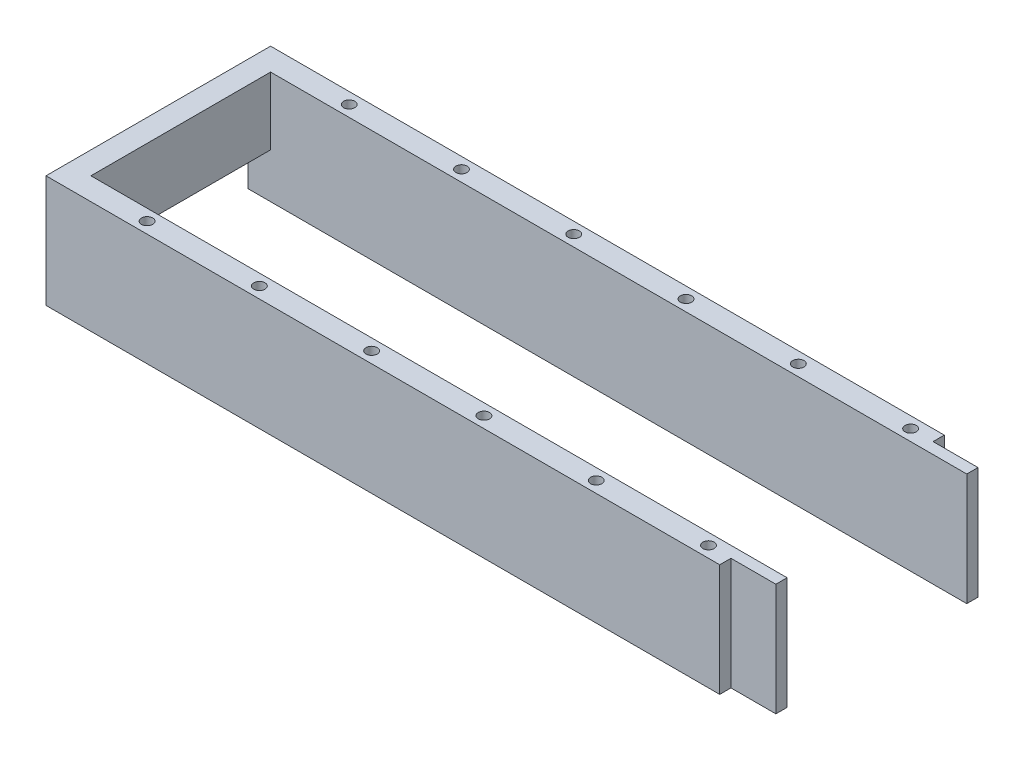
ISO-10303-21;
HEADER;
FILE_DESCRIPTION(('STEP AP214'),'2;1');
FILE_NAME('part.step','',(''),(''),'','','');
FILE_SCHEMA(('AUTOMOTIVE_DESIGN { 1 0 10303 214 1 1 1 1 }'));
ENDSEC;
DATA;
#1=APPLICATION_CONTEXT('core data for automotive mechanical design processes');
#2=APPLICATION_PROTOCOL_DEFINITION('international standard','automotive_design',2000,#1);
#3=PRODUCT_CONTEXT('',#1,'mechanical');
#4=PRODUCT('Part','Part','',(#3));
#5=PRODUCT_RELATED_PRODUCT_CATEGORY('part','',(#4));
#6=PRODUCT_DEFINITION_FORMATION('','',#4);
#7=PRODUCT_DEFINITION_CONTEXT('part definition',#1,'design');
#8=PRODUCT_DEFINITION('design','',#6,#7);
#9=PRODUCT_DEFINITION_SHAPE('','',#8);
#10=(LENGTH_UNIT() NAMED_UNIT(*) SI_UNIT(.MILLI.,.METRE.));
#11=(NAMED_UNIT(*) PLANE_ANGLE_UNIT() SI_UNIT($,.RADIAN.));
#12=(NAMED_UNIT(*) SI_UNIT($,.STERADIAN.) SOLID_ANGLE_UNIT());
#13=UNCERTAINTY_MEASURE_WITH_UNIT(LENGTH_MEASURE(1.E-05),#10,'distance_accuracy_value','');
#14=(GEOMETRIC_REPRESENTATION_CONTEXT(3) GLOBAL_UNCERTAINTY_ASSIGNED_CONTEXT((#13)) GLOBAL_UNIT_ASSIGNED_CONTEXT((#10,
#11,#12)) REPRESENTATION_CONTEXT('',''));
#15=CARTESIAN_POINT('',(0.,0.,0.));
#16=DIRECTION('',(0.,0.,1.));
#17=DIRECTION('',(1.,0.,0.));
#18=AXIS2_PLACEMENT_3D('',#15,#16,#17);
#19=CARTESIAN_POINT('',(-101.6,31.75,3.17499999999999));
#20=DIRECTION('',(0.,0.,-1.));
#21=DIRECTION('',(-1.,0.,0.));
#22=AXIS2_PLACEMENT_3D('',#19,#20,#21);
#23=PLANE('',#22);
#24=DIRECTION('',(0.,1.,0.));
#25=VECTOR('',#24,1.);
#26=CARTESIAN_POINT('',(-95.25,31.75,3.17499999999999));
#27=LINE('',#26,#25);
#28=CARTESIAN_POINT('',(-95.25,12.7,3.17499999999999));
#29=VERTEX_POINT('',#28);
#30=CARTESIAN_POINT('',(-95.25,31.75,3.17499999999999));
#31=VERTEX_POINT('',#30);
#32=EDGE_CURVE('E293',#29,#31,#27,.T.);
#33=ORIENTED_EDGE('',*,*,#32,.F.);
#34=DIRECTION('',(1.,0.,0.));
#35=VECTOR('',#34,1.);
#36=CARTESIAN_POINT('',(-101.6,12.7,3.17499999999999));
#37=LINE('',#36,#35);
#38=CARTESIAN_POINT('',(-101.6,12.7,3.17499999999999));
#39=VERTEX_POINT('',#38);
#40=EDGE_CURVE('E287',#39,#29,#37,.T.);
#41=ORIENTED_EDGE('',*,*,#40,.F.);
#42=DIRECTION('',(0.,-1.,0.));
#43=VECTOR('',#42,1.);
#44=CARTESIAN_POINT('',(-101.6,31.75,3.17499999999999));
#45=LINE('',#44,#43);
#46=CARTESIAN_POINT('',(-101.6,0.,3.17499999999999));
#47=VERTEX_POINT('',#46);
#48=EDGE_CURVE('E53',#39,#47,#45,.T.);
#49=ORIENTED_EDGE('',*,*,#48,.T.);
#50=DIRECTION('',(1.,0.,0.));
#51=VECTOR('',#50,1.);
#52=CARTESIAN_POINT('',(-101.6,0.,3.17499999999999));
#53=LINE('',#52,#51);
#54=CARTESIAN_POINT('',(101.6,0.,3.17499999999999));
#55=VERTEX_POINT('',#54);
#56=EDGE_CURVE('E369',#47,#55,#53,.T.);
#57=ORIENTED_EDGE('',*,*,#56,.T.);
#58=DIRECTION('',(0.,-1.,0.));
#59=VECTOR('',#58,1.);
#60=CARTESIAN_POINT('',(101.6,31.75,3.17499999999999));
#61=LINE('',#60,#59);
#62=CARTESIAN_POINT('',(101.6,31.75,3.17499999999999));
#63=VERTEX_POINT('',#62);
#64=EDGE_CURVE('E379',#63,#55,#61,.T.);
#65=ORIENTED_EDGE('',*,*,#64,.F.);
#66=DIRECTION('',(1.,0.,0.));
#67=VECTOR('',#66,1.);
#68=CARTESIAN_POINT('',(-101.6,31.75,3.17499999999999));
#69=LINE('',#68,#67);
#70=EDGE_CURVE('E376',#31,#63,#69,.T.);
#71=ORIENTED_EDGE('',*,*,#70,.F.);
#72=EDGE_LOOP('',(#33,#41,#49,#57,#65,#71));
#73=FACE_BOUND('',#72,.T.);
#74=ADVANCED_FACE('F44',(#73),#23,.F.);
#75=CARTESIAN_POINT('',(0.,31.75,0.));
#76=DIRECTION('',(0.,-1.,0.));
#77=DIRECTION('',(0.,0.,-1.));
#78=AXIS2_PLACEMENT_3D('',#75,#76,#77);
#79=PLANE('',#78);
#80=DIRECTION('',(0.,0.,-1.));
#81=VECTOR('',#80,1.);
#82=CARTESIAN_POINT('',(101.6,31.75,3.17499999999999));
#83=LINE('',#82,#81);
#84=CARTESIAN_POINT('',(101.6,31.75,0.));
#85=VERTEX_POINT('',#84);
#86=EDGE_CURVE('E364',#63,#85,#83,.T.);
#87=ORIENTED_EDGE('',*,*,#86,.T.);
#88=DIRECTION('',(1.,0.,0.));
#89=VECTOR('',#88,1.);
#90=CARTESIAN_POINT('',(101.6,31.75,0.));
#91=LINE('',#90,#89);
#92=CARTESIAN_POINT('',(88.9,31.75,0.));
#93=VERTEX_POINT('',#92);
#94=EDGE_CURVE('E170',#93,#85,#91,.T.);
#95=ORIENTED_EDGE('',*,*,#94,.F.);
#96=DIRECTION('',(0.,0.,1.));
#97=VECTOR('',#96,1.);
#98=CARTESIAN_POINT('',(88.9,31.75,-3.17499999999999));
#99=LINE('',#98,#97);
#100=CARTESIAN_POINT('',(88.9,31.75,-3.17499999999999));
#101=VERTEX_POINT('',#100);
#102=EDGE_CURVE('E148',#101,#93,#99,.T.);
#103=ORIENTED_EDGE('',*,*,#102,.F.);
#104=DIRECTION('',(-1.,0.,0.));
#105=VECTOR('',#104,1.);
#106=CARTESIAN_POINT('',(-101.6,31.75,-3.17500000000001));
#107=LINE('',#106,#105);
#108=CARTESIAN_POINT('',(-101.6,31.75,-3.17500000000001));
#109=VERTEX_POINT('',#108);
#110=EDGE_CURVE('E368',#101,#109,#107,.T.);
#111=ORIENTED_EDGE('',*,*,#110,.T.);
#112=DIRECTION('',(0.,0.,1.));
#113=VECTOR('',#112,1.);
#114=CARTESIAN_POINT('',(-101.6,31.75,3.17499999999999));
#115=LINE('',#114,#113);
#116=CARTESIAN_POINT('',(-101.6,31.75,60.325));
#117=VERTEX_POINT('',#116);
#118=EDGE_CURVE('E372',#109,#117,#115,.T.);
#119=ORIENTED_EDGE('',*,*,#118,.T.);
#120=DIRECTION('',(-1.,0.,0.));
#121=VECTOR('',#120,1.);
#122=CARTESIAN_POINT('',(-101.6,31.75,60.325));
#123=LINE('',#122,#121);
#124=CARTESIAN_POINT('',(88.9,31.75,60.325));
#125=VERTEX_POINT('',#124);
#126=EDGE_CURVE('E261',#125,#117,#123,.T.);
#127=ORIENTED_EDGE('',*,*,#126,.F.);
#128=DIRECTION('',(0.,0.,1.));
#129=VECTOR('',#128,1.);
#130=CARTESIAN_POINT('',(88.9,31.75,60.325));
#131=LINE('',#130,#129);
#132=CARTESIAN_POINT('',(88.9,31.75,57.15));
#133=VERTEX_POINT('',#132);
#134=EDGE_CURVE('E193',#133,#125,#131,.T.);
#135=ORIENTED_EDGE('',*,*,#134,.F.);
#136=DIRECTION('',(-1.,0.,0.));
#137=VECTOR('',#136,1.);
#138=CARTESIAN_POINT('',(101.6,31.75,57.15));
#139=LINE('',#138,#137);
#140=CARTESIAN_POINT('',(101.6,31.75,57.15));
#141=VERTEX_POINT('',#140);
#142=EDGE_CURVE('E176',#141,#133,#139,.T.);
#143=ORIENTED_EDGE('',*,*,#142,.F.);
#144=DIRECTION('',(0.,0.,1.));
#145=VECTOR('',#144,1.);
#146=CARTESIAN_POINT('',(101.6,31.75,53.975));
#147=LINE('',#146,#145);
#148=CARTESIAN_POINT('',(101.6,31.75,53.975));
#149=VERTEX_POINT('',#148);
#150=EDGE_CURVE('E253',#149,#141,#147,.T.);
#151=ORIENTED_EDGE('',*,*,#150,.F.);
#152=DIRECTION('',(1.,0.,0.));
#153=VECTOR('',#152,1.);
#154=CARTESIAN_POINT('',(-101.6,31.75,53.975));
#155=LINE('',#154,#153);
#156=CARTESIAN_POINT('',(-95.25,31.75,53.975));
#157=VERTEX_POINT('',#156);
#158=EDGE_CURVE('E257',#157,#149,#155,.T.);
#159=ORIENTED_EDGE('',*,*,#158,.F.);
#160=DIRECTION('',(0.,0.,-1.));
#161=VECTOR('',#160,1.);
#162=CARTESIAN_POINT('',(-95.25,31.75,53.975));
#163=LINE('',#162,#161);
#164=EDGE_CURVE('E297',#157,#31,#163,.T.);
#165=ORIENTED_EDGE('',*,*,#164,.T.);
#166=ORIENTED_EDGE('',*,*,#70,.T.);
#167=EDGE_LOOP('',(#87,#95,#103,#111,#119,#127,#135,#143,#151,#159,#165,#166));
#168=FACE_BOUND('',#167,.T.);
#169=CARTESIAN_POINT('',(-76.2,31.75,0.));
#170=DIRECTION('',(0.,1.,0.));
#171=DIRECTION('',(0.,0.,1.));
#172=AXIS2_PLACEMENT_3D('',#169,#170,#171);
#173=CIRCLE('',#172,1.5875);
#174=CARTESIAN_POINT('',(-76.2,31.75,1.5875));
#175=VERTEX_POINT('',#174);
#176=EDGE_CURVE('E356',#175,#175,#173,.T.);
#177=ORIENTED_EDGE('',*,*,#176,.F.);
#178=EDGE_LOOP('',(#177));
#179=FACE_BOUND('',#178,.T.);
#180=CARTESIAN_POINT('',(-44.45,31.75,0.));
#181=DIRECTION('',(0.,1.,0.));
#182=DIRECTION('',(0.,0.,1.));
#183=AXIS2_PLACEMENT_3D('',#180,#181,#182);
#184=CIRCLE('',#183,1.5875);
#185=CARTESIAN_POINT('',(-44.45,31.75,1.5875));
#186=VERTEX_POINT('',#185);
#187=EDGE_CURVE('E348',#186,#186,#184,.T.);
#188=ORIENTED_EDGE('',*,*,#187,.F.);
#189=EDGE_LOOP('',(#188));
#190=FACE_BOUND('',#189,.T.);
#191=CARTESIAN_POINT('',(-12.7,31.75,0.));
#192=DIRECTION('',(0.,1.,0.));
#193=DIRECTION('',(0.,0.,1.));
#194=AXIS2_PLACEMENT_3D('',#191,#192,#193);
#195=CIRCLE('',#194,1.5875);
#196=CARTESIAN_POINT('',(-12.7,31.75,1.5875));
#197=VERTEX_POINT('',#196);
#198=EDGE_CURVE('E340',#197,#197,#195,.T.);
#199=ORIENTED_EDGE('',*,*,#198,.F.);
#200=EDGE_LOOP('',(#199));
#201=FACE_BOUND('',#200,.T.);
#202=CARTESIAN_POINT('',(19.05,31.75,0.));
#203=DIRECTION('',(0.,1.,0.));
#204=DIRECTION('',(0.,0.,1.));
#205=AXIS2_PLACEMENT_3D('',#202,#203,#204);
#206=CIRCLE('',#205,1.5875);
#207=CARTESIAN_POINT('',(19.05,31.75,1.5875));
#208=VERTEX_POINT('',#207);
#209=EDGE_CURVE('E332',#208,#208,#206,.T.);
#210=ORIENTED_EDGE('',*,*,#209,.F.);
#211=EDGE_LOOP('',(#210));
#212=FACE_BOUND('',#211,.T.);
#213=CARTESIAN_POINT('',(50.8,31.75,0.));
#214=DIRECTION('',(0.,1.,0.));
#215=DIRECTION('',(0.,0.,1.));
#216=AXIS2_PLACEMENT_3D('',#213,#214,#215);
#217=CIRCLE('',#216,1.5875);
#218=CARTESIAN_POINT('',(50.8,31.75,1.5875));
#219=VERTEX_POINT('',#218);
#220=EDGE_CURVE('E324',#219,#219,#217,.T.);
#221=ORIENTED_EDGE('',*,*,#220,.F.);
#222=EDGE_LOOP('',(#221));
#223=FACE_BOUND('',#222,.T.);
#224=CARTESIAN_POINT('',(82.55,31.75,0.));
#225=DIRECTION('',(0.,1.,0.));
#226=DIRECTION('',(0.,0.,1.));
#227=AXIS2_PLACEMENT_3D('',#224,#225,#226);
#228=CIRCLE('',#227,1.5875);
#229=CARTESIAN_POINT('',(82.55,31.75,1.5875));
#230=VERTEX_POINT('',#229);
#231=EDGE_CURVE('E316',#230,#230,#228,.T.);
#232=ORIENTED_EDGE('',*,*,#231,.F.);
#233=EDGE_LOOP('',(#232));
#234=FACE_BOUND('',#233,.T.);
#235=CARTESIAN_POINT('',(82.55,31.75,57.15));
#236=DIRECTION('',(0.,-1.,0.));
#237=DIRECTION('',(0.,0.,-1.));
#238=AXIS2_PLACEMENT_3D('',#235,#236,#237);
#239=CIRCLE('',#238,1.5875);
#240=CARTESIAN_POINT('',(82.55,31.75,55.5625));
#241=VERTEX_POINT('',#240);
#242=EDGE_CURVE('E205',#241,#241,#239,.T.);
#243=ORIENTED_EDGE('',*,*,#242,.T.);
#244=EDGE_LOOP('',(#243));
#245=FACE_BOUND('',#244,.T.);
#246=CARTESIAN_POINT('',(50.8,31.75,57.15));
#247=DIRECTION('',(0.,-1.,0.));
#248=DIRECTION('',(0.,0.,-1.));
#249=AXIS2_PLACEMENT_3D('',#246,#247,#248);
#250=CIRCLE('',#249,1.5875);
#251=CARTESIAN_POINT('',(50.8,31.75,55.5625));
#252=VERTEX_POINT('',#251);
#253=EDGE_CURVE('E213',#252,#252,#250,.T.);
#254=ORIENTED_EDGE('',*,*,#253,.T.);
#255=EDGE_LOOP('',(#254));
#256=FACE_BOUND('',#255,.T.);
#257=CARTESIAN_POINT('',(19.05,31.75,57.15));
#258=DIRECTION('',(0.,-1.,0.));
#259=DIRECTION('',(0.,0.,-1.));
#260=AXIS2_PLACEMENT_3D('',#257,#258,#259);
#261=CIRCLE('',#260,1.5875);
#262=CARTESIAN_POINT('',(19.05,31.75,55.5625));
#263=VERTEX_POINT('',#262);
#264=EDGE_CURVE('E221',#263,#263,#261,.T.);
#265=ORIENTED_EDGE('',*,*,#264,.T.);
#266=EDGE_LOOP('',(#265));
#267=FACE_BOUND('',#266,.T.);
#268=CARTESIAN_POINT('',(-12.7,31.75,57.15));
#269=DIRECTION('',(0.,-1.,0.));
#270=DIRECTION('',(0.,0.,-1.));
#271=AXIS2_PLACEMENT_3D('',#268,#269,#270);
#272=CIRCLE('',#271,1.5875);
#273=CARTESIAN_POINT('',(-12.7,31.75,55.5625));
#274=VERTEX_POINT('',#273);
#275=EDGE_CURVE('E229',#274,#274,#272,.T.);
#276=ORIENTED_EDGE('',*,*,#275,.T.);
#277=EDGE_LOOP('',(#276));
#278=FACE_BOUND('',#277,.T.);
#279=CARTESIAN_POINT('',(-44.45,31.75,57.15));
#280=DIRECTION('',(0.,-1.,0.));
#281=DIRECTION('',(0.,0.,-1.));
#282=AXIS2_PLACEMENT_3D('',#279,#280,#281);
#283=CIRCLE('',#282,1.5875);
#284=CARTESIAN_POINT('',(-44.45,31.75,55.5625));
#285=VERTEX_POINT('',#284);
#286=EDGE_CURVE('E237',#285,#285,#283,.T.);
#287=ORIENTED_EDGE('',*,*,#286,.T.);
#288=EDGE_LOOP('',(#287));
#289=FACE_BOUND('',#288,.T.);
#290=CARTESIAN_POINT('',(-76.2,31.75,57.15));
#291=DIRECTION('',(0.,-1.,0.));
#292=DIRECTION('',(0.,0.,-1.));
#293=AXIS2_PLACEMENT_3D('',#290,#291,#292);
#294=CIRCLE('',#293,1.5875);
#295=CARTESIAN_POINT('',(-76.2,31.75,55.5625));
#296=VERTEX_POINT('',#295);
#297=EDGE_CURVE('E245',#296,#296,#294,.T.);
#298=ORIENTED_EDGE('',*,*,#297,.T.);
#299=EDGE_LOOP('',(#298));
#300=FACE_BOUND('',#299,.T.);
#301=ADVANCED_FACE('F409',(#168,#179,#190,#201,#212,#223,#234,#245,#256,#267,#278,#289,#300),
#79,.F.);
#302=CARTESIAN_POINT('',(0.,0.,0.));
#303=DIRECTION('',(0.,-1.,0.));
#304=DIRECTION('',(0.,0.,-1.));
#305=AXIS2_PLACEMENT_3D('',#302,#303,#304);
#306=PLANE('',#305);
#307=DIRECTION('',(1.,0.,0.));
#308=VECTOR('',#307,1.);
#309=CARTESIAN_POINT('',(101.6,0.,0.));
#310=LINE('',#309,#308);
#311=CARTESIAN_POINT('',(88.9,0.,0.));
#312=VERTEX_POINT('',#311);
#313=CARTESIAN_POINT('',(101.6,0.,0.));
#314=VERTEX_POINT('',#313);
#315=EDGE_CURVE('E156',#312,#314,#310,.T.);
#316=ORIENTED_EDGE('',*,*,#315,.T.);
#317=DIRECTION('',(0.,0.,-1.));
#318=VECTOR('',#317,1.);
#319=CARTESIAN_POINT('',(101.6,0.,3.17499999999999));
#320=LINE('',#319,#318);
#321=EDGE_CURVE('E360',#55,#314,#320,.T.);
#322=ORIENTED_EDGE('',*,*,#321,.F.);
#323=ORIENTED_EDGE('',*,*,#56,.F.);
#324=DIRECTION('',(0.,0.,1.));
#325=VECTOR('',#324,1.);
#326=CARTESIAN_POINT('',(-101.6,0.,3.17499999999999));
#327=LINE('',#326,#325);
#328=CARTESIAN_POINT('',(-101.6,0.,-3.17500000000001));
#329=VERTEX_POINT('',#328);
#330=EDGE_CURVE('E384',#329,#47,#327,.T.);
#331=ORIENTED_EDGE('',*,*,#330,.F.);
#332=DIRECTION('',(-1.,0.,0.));
#333=VECTOR('',#332,1.);
#334=CARTESIAN_POINT('',(-101.6,0.,-3.17500000000001));
#335=LINE('',#334,#333);
#336=CARTESIAN_POINT('',(88.9,0.,-3.17499999999999));
#337=VERTEX_POINT('',#336);
#338=EDGE_CURVE('E168',#337,#329,#335,.T.);
#339=ORIENTED_EDGE('',*,*,#338,.F.);
#340=DIRECTION('',(0.,0.,1.));
#341=VECTOR('',#340,1.);
#342=CARTESIAN_POINT('',(88.9,0.,-3.17499999999999));
#343=LINE('',#342,#341);
#344=EDGE_CURVE('E60',#337,#312,#343,.T.);
#345=ORIENTED_EDGE('',*,*,#344,.T.);
#346=EDGE_LOOP('',(#316,#322,#323,#331,#339,#345));
#347=FACE_BOUND('',#346,.T.);
#348=CARTESIAN_POINT('',(50.8,0.,0.));
#349=DIRECTION('',(0.,1.,0.));
#350=DIRECTION('',(0.,0.,1.));
#351=AXIS2_PLACEMENT_3D('',#348,#349,#350);
#352=CIRCLE('',#351,1.5875);
#353=CARTESIAN_POINT('',(50.8,0.,1.5875));
#354=VERTEX_POINT('',#353);
#355=EDGE_CURVE('E320',#354,#354,#352,.T.);
#356=ORIENTED_EDGE('',*,*,#355,.T.);
#357=EDGE_LOOP('',(#356));
#358=FACE_BOUND('',#357,.T.);
#359=CARTESIAN_POINT('',(-12.7,0.,0.));
#360=DIRECTION('',(0.,1.,0.));
#361=DIRECTION('',(0.,0.,1.));
#362=AXIS2_PLACEMENT_3D('',#359,#360,#361);
#363=CIRCLE('',#362,1.5875);
#364=CARTESIAN_POINT('',(-12.7,0.,1.5875));
#365=VERTEX_POINT('',#364);
#366=EDGE_CURVE('E336',#365,#365,#363,.T.);
#367=ORIENTED_EDGE('',*,*,#366,.T.);
#368=EDGE_LOOP('',(#367));
#369=FACE_BOUND('',#368,.T.);
#370=CARTESIAN_POINT('',(-76.2,0.,0.));
#371=DIRECTION('',(0.,1.,0.));
#372=DIRECTION('',(0.,0.,1.));
#373=AXIS2_PLACEMENT_3D('',#370,#371,#372);
#374=CIRCLE('',#373,1.5875);
#375=CARTESIAN_POINT('',(-76.2,0.,1.5875));
#376=VERTEX_POINT('',#375);
#377=EDGE_CURVE('E352',#376,#376,#374,.T.);
#378=ORIENTED_EDGE('',*,*,#377,.T.);
#379=EDGE_LOOP('',(#378));
#380=FACE_BOUND('',#379,.T.);
#381=CARTESIAN_POINT('',(-44.45,0.,0.));
#382=DIRECTION('',(0.,1.,0.));
#383=DIRECTION('',(0.,0.,1.));
#384=AXIS2_PLACEMENT_3D('',#381,#382,#383);
#385=CIRCLE('',#384,1.5875);
#386=CARTESIAN_POINT('',(-44.45,0.,1.5875));
#387=VERTEX_POINT('',#386);
#388=EDGE_CURVE('E344',#387,#387,#385,.T.);
#389=ORIENTED_EDGE('',*,*,#388,.T.);
#390=EDGE_LOOP('',(#389));
#391=FACE_BOUND('',#390,.T.);
#392=CARTESIAN_POINT('',(19.05,0.,0.));
#393=DIRECTION('',(0.,1.,0.));
#394=DIRECTION('',(0.,0.,1.));
#395=AXIS2_PLACEMENT_3D('',#392,#393,#394);
#396=CIRCLE('',#395,1.5875);
#397=CARTESIAN_POINT('',(19.05,0.,1.5875));
#398=VERTEX_POINT('',#397);
#399=EDGE_CURVE('E328',#398,#398,#396,.T.);
#400=ORIENTED_EDGE('',*,*,#399,.T.);
#401=EDGE_LOOP('',(#400));
#402=FACE_BOUND('',#401,.T.);
#403=CARTESIAN_POINT('',(82.55,0.,0.));
#404=DIRECTION('',(0.,1.,0.));
#405=DIRECTION('',(0.,0.,1.));
#406=AXIS2_PLACEMENT_3D('',#403,#404,#405);
#407=CIRCLE('',#406,1.5875);
#408=CARTESIAN_POINT('',(82.55,0.,1.5875));
#409=VERTEX_POINT('',#408);
#410=EDGE_CURVE('E315',#409,#409,#407,.T.);
#411=ORIENTED_EDGE('',*,*,#410,.T.);
#412=EDGE_LOOP('',(#411));
#413=FACE_BOUND('',#412,.T.);
#414=ADVANCED_FACE('F165',(#347,#358,#369,#380,#391,#402,#413),#306,.T.);
#415=CARTESIAN_POINT('',(101.6,31.75,3.17499999999999));
#416=DIRECTION('',(-1.,0.,0.));
#417=DIRECTION('',(0.,0.,1.));
#418=AXIS2_PLACEMENT_3D('',#415,#416,#417);
#419=PLANE('',#418);
#420=ORIENTED_EDGE('',*,*,#321,.T.);
#421=DIRECTION('',(0.,1.,0.));
#422=VECTOR('',#421,1.);
#423=CARTESIAN_POINT('',(101.6,0.,0.));
#424=LINE('',#423,#422);
#425=EDGE_CURVE('E152',#314,#85,#424,.T.);
#426=ORIENTED_EDGE('',*,*,#425,.T.);
#427=ORIENTED_EDGE('',*,*,#86,.F.);
#428=ORIENTED_EDGE('',*,*,#64,.T.);
#429=EDGE_LOOP('',(#420,#426,#427,#428));
#430=FACE_BOUND('',#429,.T.);
#431=ADVANCED_FACE('F46',(#430),#419,.F.);
#432=CARTESIAN_POINT('',(-101.6,31.75,-3.17500000000001));
#433=DIRECTION('',(0.,0.,1.));
#434=DIRECTION('',(1.,0.,0.));
#435=AXIS2_PLACEMENT_3D('',#432,#433,#434);
#436=PLANE('',#435);
#437=ORIENTED_EDGE('',*,*,#110,.F.);
#438=DIRECTION('',(0.,1.,0.));
#439=VECTOR('',#438,1.);
#440=CARTESIAN_POINT('',(88.9,0.,-3.17499999999999));
#441=LINE('',#440,#439);
#442=EDGE_CURVE('E153',#337,#101,#441,.T.);
#443=ORIENTED_EDGE('',*,*,#442,.F.);
#444=ORIENTED_EDGE('',*,*,#338,.T.);
#445=DIRECTION('',(0.,-1.,0.));
#446=VECTOR('',#445,1.);
#447=CARTESIAN_POINT('',(-101.6,31.75,-3.17500000000001));
#448=LINE('',#447,#446);
#449=EDGE_CURVE('E11',#109,#329,#448,.T.);
#450=ORIENTED_EDGE('',*,*,#449,.F.);
#451=EDGE_LOOP('',(#437,#443,#444,#450));
#452=FACE_BOUND('',#451,.T.);
#453=ADVANCED_FACE('F451',(#452),#436,.F.);
#454=CARTESIAN_POINT('',(-101.6,31.75,3.17499999999999));
#455=DIRECTION('',(1.,0.,0.));
#456=DIRECTION('',(0.,0.,-1.));
#457=AXIS2_PLACEMENT_3D('',#454,#455,#456);
#458=PLANE('',#457);
#459=ORIENTED_EDGE('',*,*,#330,.T.);
#460=ORIENTED_EDGE('',*,*,#48,.F.);
#461=DIRECTION('',(0.,0.,-1.));
#462=VECTOR('',#461,1.);
#463=CARTESIAN_POINT('',(-101.6,12.7,53.975));
#464=LINE('',#463,#462);
#465=CARTESIAN_POINT('',(-101.6,12.7,53.975));
#466=VERTEX_POINT('',#465);
#467=EDGE_CURVE('E311',#466,#39,#464,.T.);
#468=ORIENTED_EDGE('',*,*,#467,.F.);
#469=DIRECTION('',(0.,-1.,0.));
#470=VECTOR('',#469,1.);
#471=CARTESIAN_POINT('',(-101.6,31.75,53.975));
#472=LINE('',#471,#470);
#473=CARTESIAN_POINT('',(-101.6,0.,53.975));
#474=VERTEX_POINT('',#473);
#475=EDGE_CURVE('E281',#466,#474,#472,.T.);
#476=ORIENTED_EDGE('',*,*,#475,.T.);
#477=DIRECTION('',(0.,0.,-1.));
#478=VECTOR('',#477,1.);
#479=CARTESIAN_POINT('',(-101.6,0.,53.975));
#480=LINE('',#479,#478);
#481=CARTESIAN_POINT('',(-101.6,0.,60.325));
#482=VERTEX_POINT('',#481);
#483=EDGE_CURVE('E272',#482,#474,#480,.T.);
#484=ORIENTED_EDGE('',*,*,#483,.F.);
#485=DIRECTION('',(0.,-1.,0.));
#486=VECTOR('',#485,1.);
#487=CARTESIAN_POINT('',(-101.6,31.75,60.325));
#488=LINE('',#487,#486);
#489=EDGE_CURVE('E264',#117,#482,#488,.T.);
#490=ORIENTED_EDGE('',*,*,#489,.F.);
#491=ORIENTED_EDGE('',*,*,#118,.F.);
#492=ORIENTED_EDGE('',*,*,#449,.T.);
#493=EDGE_LOOP('',(#459,#460,#468,#476,#484,#490,#491,#492));
#494=FACE_BOUND('',#493,.T.);
#495=ADVANCED_FACE('F399',(#494),#458,.F.);
#496=CARTESIAN_POINT('',(-76.2,31.75,0.));
#497=DIRECTION('',(0.,-1.,0.));
#498=DIRECTION('',(0.,0.,-1.));
#499=AXIS2_PLACEMENT_3D('',#496,#497,#498);
#500=CYLINDRICAL_SURFACE('',#499,1.5875);
#501=ORIENTED_EDGE('',*,*,#176,.T.);
#502=EDGE_LOOP('',(#501));
#503=FACE_BOUND('',#502,.T.);
#504=ORIENTED_EDGE('',*,*,#377,.F.);
#505=EDGE_LOOP('',(#504));
#506=FACE_BOUND('',#505,.T.);
#507=ADVANCED_FACE('F450',(#503,#506),#500,.F.);
#508=CARTESIAN_POINT('',(-44.45,31.75,0.));
#509=DIRECTION('',(0.,-1.,0.));
#510=DIRECTION('',(0.,0.,-1.));
#511=AXIS2_PLACEMENT_3D('',#508,#509,#510);
#512=CYLINDRICAL_SURFACE('',#511,1.5875);
#513=ORIENTED_EDGE('',*,*,#187,.T.);
#514=EDGE_LOOP('',(#513));
#515=FACE_BOUND('',#514,.T.);
#516=ORIENTED_EDGE('',*,*,#388,.F.);
#517=EDGE_LOOP('',(#516));
#518=FACE_BOUND('',#517,.T.);
#519=ADVANCED_FACE('F691',(#515,#518),#512,.F.);
#520=CARTESIAN_POINT('',(-12.7,31.75,0.));
#521=DIRECTION('',(0.,-1.,0.));
#522=DIRECTION('',(0.,0.,-1.));
#523=AXIS2_PLACEMENT_3D('',#520,#521,#522);
#524=CYLINDRICAL_SURFACE('',#523,1.5875);
#525=ORIENTED_EDGE('',*,*,#198,.T.);
#526=EDGE_LOOP('',(#525));
#527=FACE_BOUND('',#526,.T.);
#528=ORIENTED_EDGE('',*,*,#366,.F.);
#529=EDGE_LOOP('',(#528));
#530=FACE_BOUND('',#529,.T.);
#531=ADVANCED_FACE('F681',(#527,#530),#524,.F.);
#532=CARTESIAN_POINT('',(19.05,31.75,0.));
#533=DIRECTION('',(0.,-1.,0.));
#534=DIRECTION('',(0.,0.,-1.));
#535=AXIS2_PLACEMENT_3D('',#532,#533,#534);
#536=CYLINDRICAL_SURFACE('',#535,1.5875);
#537=ORIENTED_EDGE('',*,*,#209,.T.);
#538=EDGE_LOOP('',(#537));
#539=FACE_BOUND('',#538,.T.);
#540=ORIENTED_EDGE('',*,*,#399,.F.);
#541=EDGE_LOOP('',(#540));
#542=FACE_BOUND('',#541,.T.);
#543=ADVANCED_FACE('F671',(#539,#542),#536,.F.);
#544=CARTESIAN_POINT('',(50.8,31.75,0.));
#545=DIRECTION('',(0.,-1.,0.));
#546=DIRECTION('',(0.,0.,-1.));
#547=AXIS2_PLACEMENT_3D('',#544,#545,#546);
#548=CYLINDRICAL_SURFACE('',#547,1.5875);
#549=ORIENTED_EDGE('',*,*,#220,.T.);
#550=EDGE_LOOP('',(#549));
#551=FACE_BOUND('',#550,.T.);
#552=ORIENTED_EDGE('',*,*,#355,.F.);
#553=EDGE_LOOP('',(#552));
#554=FACE_BOUND('',#553,.T.);
#555=ADVANCED_FACE('F437',(#551,#554),#548,.F.);
#556=CARTESIAN_POINT('',(82.55,31.75,0.));
#557=DIRECTION('',(0.,-1.,0.));
#558=DIRECTION('',(0.,0.,-1.));
#559=AXIS2_PLACEMENT_3D('',#556,#557,#558);
#560=CYLINDRICAL_SURFACE('',#559,1.5875);
#561=ORIENTED_EDGE('',*,*,#231,.T.);
#562=EDGE_LOOP('',(#561));
#563=FACE_BOUND('',#562,.T.);
#564=ORIENTED_EDGE('',*,*,#410,.F.);
#565=EDGE_LOOP('',(#564));
#566=FACE_BOUND('',#565,.T.);
#567=ADVANCED_FACE('F430',(#563,#566),#560,.F.);
#568=CARTESIAN_POINT('',(-101.6,12.7,53.975));
#569=DIRECTION('',(0.,1.,0.));
#570=DIRECTION('',(-1.,0.,0.));
#571=AXIS2_PLACEMENT_3D('',#568,#569,#570);
#572=PLANE('',#571);
#573=ORIENTED_EDGE('',*,*,#40,.T.);
#574=DIRECTION('',(0.,0.,-1.));
#575=VECTOR('',#574,1.);
#576=CARTESIAN_POINT('',(-95.25,12.7,53.975));
#577=LINE('',#576,#575);
#578=CARTESIAN_POINT('',(-95.25,12.7,53.975));
#579=VERTEX_POINT('',#578);
#580=EDGE_CURVE('E307',#579,#29,#577,.T.);
#581=ORIENTED_EDGE('',*,*,#580,.F.);
#582=DIRECTION('',(1.,0.,0.));
#583=VECTOR('',#582,1.);
#584=CARTESIAN_POINT('',(-101.6,12.7,53.975));
#585=LINE('',#584,#583);
#586=EDGE_CURVE('E288',#466,#579,#585,.T.);
#587=ORIENTED_EDGE('',*,*,#586,.F.);
#588=ORIENTED_EDGE('',*,*,#467,.T.);
#589=EDGE_LOOP('',(#573,#581,#587,#588));
#590=FACE_BOUND('',#589,.T.);
#591=ADVANCED_FACE('F428',(#590),#572,.F.);
#592=CARTESIAN_POINT('',(-95.25,31.75,53.975));
#593=DIRECTION('',(-1.,0.,0.));
#594=DIRECTION('',(0.,0.,1.));
#595=AXIS2_PLACEMENT_3D('',#592,#593,#594);
#596=PLANE('',#595);
#597=ORIENTED_EDGE('',*,*,#32,.T.);
#598=ORIENTED_EDGE('',*,*,#164,.F.);
#599=DIRECTION('',(0.,1.,0.));
#600=VECTOR('',#599,1.);
#601=CARTESIAN_POINT('',(-95.25,31.75,53.975));
#602=LINE('',#601,#600);
#603=EDGE_CURVE('E292',#579,#157,#602,.T.);
#604=ORIENTED_EDGE('',*,*,#603,.F.);
#605=ORIENTED_EDGE('',*,*,#580,.T.);
#606=EDGE_LOOP('',(#597,#598,#604,#605));
#607=FACE_BOUND('',#606,.T.);
#608=ADVANCED_FACE('F406',(#607),#596,.F.);
#609=CARTESIAN_POINT('',(101.6,31.75,53.975));
#610=DIRECTION('',(1.,0.,0.));
#611=DIRECTION('',(0.,0.,-1.));
#612=AXIS2_PLACEMENT_3D('',#609,#610,#611);
#613=PLANE('',#612);
#614=DIRECTION('',(0.,1.,0.));
#615=VECTOR('',#614,1.);
#616=CARTESIAN_POINT('',(101.6,0.,57.15));
#617=LINE('',#616,#615);
#618=CARTESIAN_POINT('',(101.6,0.,57.15));
#619=VERTEX_POINT('',#618);
#620=EDGE_CURVE('E183',#619,#141,#617,.T.);
#621=ORIENTED_EDGE('',*,*,#620,.F.);
#622=DIRECTION('',(0.,0.,1.));
#623=VECTOR('',#622,1.);
#624=CARTESIAN_POINT('',(101.6,0.,53.975));
#625=LINE('',#624,#623);
#626=CARTESIAN_POINT('',(101.6,0.,53.975));
#627=VERTEX_POINT('',#626);
#628=EDGE_CURVE('E249',#627,#619,#625,.T.);
#629=ORIENTED_EDGE('',*,*,#628,.F.);
#630=DIRECTION('',(0.,-1.,0.));
#631=VECTOR('',#630,1.);
#632=CARTESIAN_POINT('',(101.6,31.75,53.975));
#633=LINE('',#632,#631);
#634=EDGE_CURVE('E284',#149,#627,#633,.T.);
#635=ORIENTED_EDGE('',*,*,#634,.F.);
#636=ORIENTED_EDGE('',*,*,#150,.T.);
#637=EDGE_LOOP('',(#621,#629,#635,#636));
#638=FACE_BOUND('',#637,.T.);
#639=ADVANCED_FACE('F421',(#638),#613,.T.);
#640=CARTESIAN_POINT('',(-101.6,31.75,53.975));
#641=DIRECTION('',(0.,0.,-1.));
#642=DIRECTION('',(-1.,0.,0.));
#643=AXIS2_PLACEMENT_3D('',#640,#641,#642);
#644=PLANE('',#643);
#645=ORIENTED_EDGE('',*,*,#475,.F.);
#646=ORIENTED_EDGE('',*,*,#586,.T.);
#647=ORIENTED_EDGE('',*,*,#603,.T.);
#648=ORIENTED_EDGE('',*,*,#158,.T.);
#649=ORIENTED_EDGE('',*,*,#634,.T.);
#650=DIRECTION('',(1.,0.,0.));
#651=VECTOR('',#650,1.);
#652=CARTESIAN_POINT('',(-101.6,0.,53.975));
#653=LINE('',#652,#651);
#654=EDGE_CURVE('E268',#474,#627,#653,.T.);
#655=ORIENTED_EDGE('',*,*,#654,.F.);
#656=EDGE_LOOP('',(#645,#646,#647,#648,#649,#655));
#657=FACE_BOUND('',#656,.T.);
#658=ADVANCED_FACE('F416',(#657),#644,.T.);
#659=CARTESIAN_POINT('',(-101.6,31.75,60.325));
#660=DIRECTION('',(0.,0.,1.));
#661=DIRECTION('',(1.,0.,0.));
#662=AXIS2_PLACEMENT_3D('',#659,#660,#661);
#663=PLANE('',#662);
#664=DIRECTION('',(0.,1.,0.));
#665=VECTOR('',#664,1.);
#666=CARTESIAN_POINT('',(88.9,0.,60.325));
#667=LINE('',#666,#665);
#668=CARTESIAN_POINT('',(88.9,0.,60.325));
#669=VERTEX_POINT('',#668);
#670=EDGE_CURVE('E189',#669,#125,#667,.T.);
#671=ORIENTED_EDGE('',*,*,#670,.T.);
#672=ORIENTED_EDGE('',*,*,#126,.T.);
#673=ORIENTED_EDGE('',*,*,#489,.T.);
#674=DIRECTION('',(-1.,0.,0.));
#675=VECTOR('',#674,1.);
#676=CARTESIAN_POINT('',(-101.6,0.,60.325));
#677=LINE('',#676,#675);
#678=EDGE_CURVE('E258',#669,#482,#677,.T.);
#679=ORIENTED_EDGE('',*,*,#678,.F.);
#680=EDGE_LOOP('',(#671,#672,#673,#679));
#681=FACE_BOUND('',#680,.T.);
#682=ADVANCED_FACE('F463',(#681),#663,.T.);
#683=CARTESIAN_POINT('',(0.,0.,57.15));
#684=DIRECTION('',(0.,-1.,0.));
#685=DIRECTION('',(0.,0.,1.));
#686=AXIS2_PLACEMENT_3D('',#683,#684,#685);
#687=PLANE('',#686);
#688=DIRECTION('',(0.,0.,1.));
#689=VECTOR('',#688,1.);
#690=CARTESIAN_POINT('',(88.9,0.,60.325));
#691=LINE('',#690,#689);
#692=CARTESIAN_POINT('',(88.9,0.,57.15));
#693=VERTEX_POINT('',#692);
#694=EDGE_CURVE('E68',#693,#669,#691,.T.);
#695=ORIENTED_EDGE('',*,*,#694,.T.);
#696=ORIENTED_EDGE('',*,*,#678,.T.);
#697=ORIENTED_EDGE('',*,*,#483,.T.);
#698=ORIENTED_EDGE('',*,*,#654,.T.);
#699=ORIENTED_EDGE('',*,*,#628,.T.);
#700=DIRECTION('',(-1.,0.,0.));
#701=VECTOR('',#700,1.);
#702=CARTESIAN_POINT('',(101.6,0.,57.15));
#703=LINE('',#702,#701);
#704=EDGE_CURVE('E196',#619,#693,#703,.T.);
#705=ORIENTED_EDGE('',*,*,#704,.T.);
#706=EDGE_LOOP('',(#695,#696,#697,#698,#699,#705));
#707=FACE_BOUND('',#706,.T.);
#708=CARTESIAN_POINT('',(82.55,0.,57.15));
#709=DIRECTION('',(0.,-1.,0.));
#710=DIRECTION('',(0.,0.,-1.));
#711=AXIS2_PLACEMENT_3D('',#708,#709,#710);
#712=CIRCLE('',#711,1.5875);
#713=CARTESIAN_POINT('',(82.55,0.,55.5625));
#714=VERTEX_POINT('',#713);
#715=EDGE_CURVE('E179',#714,#714,#712,.T.);
#716=ORIENTED_EDGE('',*,*,#715,.F.);
#717=EDGE_LOOP('',(#716));
#718=FACE_BOUND('',#717,.T.);
#719=CARTESIAN_POINT('',(50.8,0.,57.15));
#720=DIRECTION('',(0.,-1.,0.));
#721=DIRECTION('',(0.,0.,-1.));
#722=AXIS2_PLACEMENT_3D('',#719,#720,#721);
#723=CIRCLE('',#722,1.5875);
#724=CARTESIAN_POINT('',(50.8,0.,55.5625));
#725=VERTEX_POINT('',#724);
#726=EDGE_CURVE('E209',#725,#725,#723,.T.);
#727=ORIENTED_EDGE('',*,*,#726,.F.);
#728=EDGE_LOOP('',(#727));
#729=FACE_BOUND('',#728,.T.);
#730=CARTESIAN_POINT('',(19.05,0.,57.15));
#731=DIRECTION('',(0.,-1.,0.));
#732=DIRECTION('',(0.,0.,-1.));
#733=AXIS2_PLACEMENT_3D('',#730,#731,#732);
#734=CIRCLE('',#733,1.5875);
#735=CARTESIAN_POINT('',(19.05,0.,55.5625));
#736=VERTEX_POINT('',#735);
#737=EDGE_CURVE('E217',#736,#736,#734,.T.);
#738=ORIENTED_EDGE('',*,*,#737,.F.);
#739=EDGE_LOOP('',(#738));
#740=FACE_BOUND('',#739,.T.);
#741=CARTESIAN_POINT('',(-12.7,0.,57.15));
#742=DIRECTION('',(0.,-1.,0.));
#743=DIRECTION('',(0.,0.,-1.));
#744=AXIS2_PLACEMENT_3D('',#741,#742,#743);
#745=CIRCLE('',#744,1.5875);
#746=CARTESIAN_POINT('',(-12.7,0.,55.5625));
#747=VERTEX_POINT('',#746);
#748=EDGE_CURVE('E225',#747,#747,#745,.T.);
#749=ORIENTED_EDGE('',*,*,#748,.F.);
#750=EDGE_LOOP('',(#749));
#751=FACE_BOUND('',#750,.T.);
#752=CARTESIAN_POINT('',(-44.45,0.,57.15));
#753=DIRECTION('',(0.,-1.,0.));
#754=DIRECTION('',(0.,0.,-1.));
#755=AXIS2_PLACEMENT_3D('',#752,#753,#754);
#756=CIRCLE('',#755,1.5875);
#757=CARTESIAN_POINT('',(-44.45,0.,55.5625));
#758=VERTEX_POINT('',#757);
#759=EDGE_CURVE('E233',#758,#758,#756,.T.);
#760=ORIENTED_EDGE('',*,*,#759,.F.);
#761=EDGE_LOOP('',(#760));
#762=FACE_BOUND('',#761,.T.);
#763=CARTESIAN_POINT('',(-76.2,0.,57.15));
#764=DIRECTION('',(0.,-1.,0.));
#765=DIRECTION('',(0.,0.,-1.));
#766=AXIS2_PLACEMENT_3D('',#763,#764,#765);
#767=CIRCLE('',#766,1.5875);
#768=CARTESIAN_POINT('',(-76.2,0.,55.5625));
#769=VERTEX_POINT('',#768);
#770=EDGE_CURVE('E241',#769,#769,#767,.T.);
#771=ORIENTED_EDGE('',*,*,#770,.F.);
#772=EDGE_LOOP('',(#771));
#773=FACE_BOUND('',#772,.T.);
#774=ADVANCED_FACE('F423',(#707,#718,#729,#740,#751,#762,#773),#687,.T.);
#775=CARTESIAN_POINT('',(-76.2,31.75,57.15));
#776=DIRECTION('',(0.,-1.,0.));
#777=DIRECTION('',(0.,0.,-1.));
#778=AXIS2_PLACEMENT_3D('',#775,#776,#777);
#779=CYLINDRICAL_SURFACE('',#778,1.5875);
#780=ORIENTED_EDGE('',*,*,#297,.F.);
#781=EDGE_LOOP('',(#780));
#782=FACE_BOUND('',#781,.T.);
#783=ORIENTED_EDGE('',*,*,#770,.T.);
#784=EDGE_LOOP('',(#783));
#785=FACE_BOUND('',#784,.T.);
#786=ADVANCED_FACE('F496',(#782,#785),#779,.F.);
#787=CARTESIAN_POINT('',(-44.45,31.75,57.15));
#788=DIRECTION('',(0.,-1.,0.));
#789=DIRECTION('',(0.,0.,-1.));
#790=AXIS2_PLACEMENT_3D('',#787,#788,#789);
#791=CYLINDRICAL_SURFACE('',#790,1.5875);
#792=ORIENTED_EDGE('',*,*,#286,.F.);
#793=EDGE_LOOP('',(#792));
#794=FACE_BOUND('',#793,.T.);
#795=ORIENTED_EDGE('',*,*,#759,.T.);
#796=EDGE_LOOP('',(#795));
#797=FACE_BOUND('',#796,.T.);
#798=ADVANCED_FACE('F492',(#794,#797),#791,.F.);
#799=CARTESIAN_POINT('',(-12.7,31.75,57.15));
#800=DIRECTION('',(0.,-1.,0.));
#801=DIRECTION('',(0.,0.,-1.));
#802=AXIS2_PLACEMENT_3D('',#799,#800,#801);
#803=CYLINDRICAL_SURFACE('',#802,1.5875);
#804=ORIENTED_EDGE('',*,*,#275,.F.);
#805=EDGE_LOOP('',(#804));
#806=FACE_BOUND('',#805,.T.);
#807=ORIENTED_EDGE('',*,*,#748,.T.);
#808=EDGE_LOOP('',(#807));
#809=FACE_BOUND('',#808,.T.);
#810=ADVANCED_FACE('F488',(#806,#809),#803,.F.);
#811=CARTESIAN_POINT('',(19.05,31.75,57.15));
#812=DIRECTION('',(0.,-1.,0.));
#813=DIRECTION('',(0.,0.,-1.));
#814=AXIS2_PLACEMENT_3D('',#811,#812,#813);
#815=CYLINDRICAL_SURFACE('',#814,1.5875);
#816=ORIENTED_EDGE('',*,*,#264,.F.);
#817=EDGE_LOOP('',(#816));
#818=FACE_BOUND('',#817,.T.);
#819=ORIENTED_EDGE('',*,*,#737,.T.);
#820=EDGE_LOOP('',(#819));
#821=FACE_BOUND('',#820,.T.);
#822=ADVANCED_FACE('F484',(#818,#821),#815,.F.);
#823=CARTESIAN_POINT('',(50.8,31.75,57.15));
#824=DIRECTION('',(0.,-1.,0.));
#825=DIRECTION('',(0.,0.,-1.));
#826=AXIS2_PLACEMENT_3D('',#823,#824,#825);
#827=CYLINDRICAL_SURFACE('',#826,1.5875);
#828=ORIENTED_EDGE('',*,*,#253,.F.);
#829=EDGE_LOOP('',(#828));
#830=FACE_BOUND('',#829,.T.);
#831=ORIENTED_EDGE('',*,*,#726,.T.);
#832=EDGE_LOOP('',(#831));
#833=FACE_BOUND('',#832,.T.);
#834=ADVANCED_FACE('F480',(#830,#833),#827,.F.);
#835=CARTESIAN_POINT('',(82.55,31.75,57.15));
#836=DIRECTION('',(0.,-1.,0.));
#837=DIRECTION('',(0.,0.,-1.));
#838=AXIS2_PLACEMENT_3D('',#835,#836,#837);
#839=CYLINDRICAL_SURFACE('',#838,1.5875);
#840=ORIENTED_EDGE('',*,*,#242,.F.);
#841=EDGE_LOOP('',(#840));
#842=FACE_BOUND('',#841,.T.);
#843=ORIENTED_EDGE('',*,*,#715,.T.);
#844=EDGE_LOOP('',(#843));
#845=FACE_BOUND('',#844,.T.);
#846=ADVANCED_FACE('F474',(#842,#845),#839,.F.);
#847=CARTESIAN_POINT('',(88.9,0.,60.325));
#848=DIRECTION('',(-1.,0.,0.));
#849=DIRECTION('',(0.,0.,1.));
#850=AXIS2_PLACEMENT_3D('',#847,#848,#849);
#851=PLANE('',#850);
#852=ORIENTED_EDGE('',*,*,#134,.T.);
#853=ORIENTED_EDGE('',*,*,#670,.F.);
#854=ORIENTED_EDGE('',*,*,#694,.F.);
#855=DIRECTION('',(0.,1.,0.));
#856=VECTOR('',#855,1.);
#857=CARTESIAN_POINT('',(88.9,0.,57.15));
#858=LINE('',#857,#856);
#859=EDGE_CURVE('E186',#693,#133,#858,.T.);
#860=ORIENTED_EDGE('',*,*,#859,.T.);
#861=EDGE_LOOP('',(#852,#853,#854,#860));
#862=FACE_BOUND('',#861,.T.);
#863=ADVANCED_FACE('F464',(#862),#851,.F.);
#864=CARTESIAN_POINT('',(101.6,0.,57.15));
#865=DIRECTION('',(0.,0.,-1.));
#866=DIRECTION('',(-1.,0.,0.));
#867=AXIS2_PLACEMENT_3D('',#864,#865,#866);
#868=PLANE('',#867);
#869=ORIENTED_EDGE('',*,*,#142,.T.);
#870=ORIENTED_EDGE('',*,*,#859,.F.);
#871=ORIENTED_EDGE('',*,*,#704,.F.);
#872=ORIENTED_EDGE('',*,*,#620,.T.);
#873=EDGE_LOOP('',(#869,#870,#871,#872));
#874=FACE_BOUND('',#873,.T.);
#875=ADVANCED_FACE('F466',(#874),#868,.F.);
#876=CARTESIAN_POINT('',(101.6,0.,0.));
#877=DIRECTION('',(0.,0.,1.));
#878=DIRECTION('',(1.,0.,0.));
#879=AXIS2_PLACEMENT_3D('',#876,#877,#878);
#880=PLANE('',#879);
#881=ORIENTED_EDGE('',*,*,#94,.T.);
#882=ORIENTED_EDGE('',*,*,#425,.F.);
#883=ORIENTED_EDGE('',*,*,#315,.F.);
#884=DIRECTION('',(0.,1.,0.));
#885=VECTOR('',#884,1.);
#886=CARTESIAN_POINT('',(88.9,0.,0.));
#887=LINE('',#886,#885);
#888=EDGE_CURVE('E144',#312,#93,#887,.T.);
#889=ORIENTED_EDGE('',*,*,#888,.T.);
#890=EDGE_LOOP('',(#881,#882,#883,#889));
#891=FACE_BOUND('',#890,.T.);
#892=ADVANCED_FACE('F157',(#891),#880,.F.);
#893=CARTESIAN_POINT('',(88.9,0.,-3.17499999999999));
#894=DIRECTION('',(-1.,0.,0.));
#895=DIRECTION('',(0.,0.,1.));
#896=AXIS2_PLACEMENT_3D('',#893,#894,#895);
#897=PLANE('',#896);
#898=ORIENTED_EDGE('',*,*,#102,.T.);
#899=ORIENTED_EDGE('',*,*,#888,.F.);
#900=ORIENTED_EDGE('',*,*,#344,.F.);
#901=ORIENTED_EDGE('',*,*,#442,.T.);
#902=EDGE_LOOP('',(#898,#899,#900,#901));
#903=FACE_BOUND('',#902,.T.);
#904=ADVANCED_FACE('F146',(#903),#897,.F.);
#905=CLOSED_SHELL('',(#74,#301,#414,#431,#453,#495,#507,#519,#531,#543,#555,#567,#591,#608,#639,
#658,#682,#774,#786,#798,#810,#822,#834,#846,#863,#875,#892,#904));
#906=MANIFOLD_SOLID_BREP('B2',#905);
#907=ADVANCED_BREP_SHAPE_REPRESENTATION('',(#18,#906),#14);
#908=SHAPE_DEFINITION_REPRESENTATION(#9,#907);
ENDSEC;
END-ISO-10303-21;
